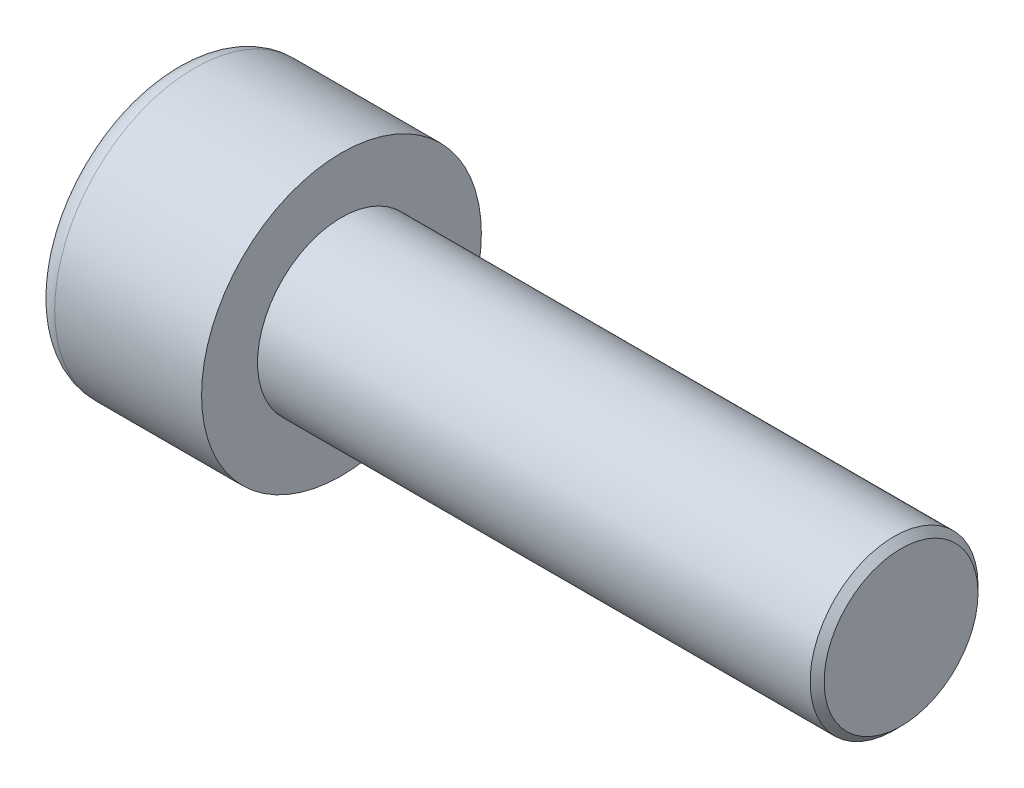
ISO-10303-21;
HEADER;
FILE_DESCRIPTION(('STEP AP214'),'2;1');
FILE_NAME('part.step','',(''),(''),'','','');
FILE_SCHEMA(('AUTOMOTIVE_DESIGN { 1 0 10303 214 1 1 1 1 }'));
ENDSEC;
DATA;
#1=APPLICATION_CONTEXT('core data for automotive mechanical design processes');
#2=APPLICATION_PROTOCOL_DEFINITION('international standard','automotive_design',2000,#1);
#3=PRODUCT_CONTEXT('',#1,'mechanical');
#4=PRODUCT('Part','Part','',(#3));
#5=PRODUCT_RELATED_PRODUCT_CATEGORY('part','',(#4));
#6=PRODUCT_DEFINITION_FORMATION('','',#4);
#7=PRODUCT_DEFINITION_CONTEXT('part definition',#1,'design');
#8=PRODUCT_DEFINITION('design','',#6,#7);
#9=PRODUCT_DEFINITION_SHAPE('','',#8);
#10=(LENGTH_UNIT() NAMED_UNIT(*) SI_UNIT(.MILLI.,.METRE.));
#11=(NAMED_UNIT(*) PLANE_ANGLE_UNIT() SI_UNIT($,.RADIAN.));
#12=(NAMED_UNIT(*) SI_UNIT($,.STERADIAN.) SOLID_ANGLE_UNIT());
#13=UNCERTAINTY_MEASURE_WITH_UNIT(LENGTH_MEASURE(1.E-05),#10,'distance_accuracy_value','');
#14=(GEOMETRIC_REPRESENTATION_CONTEXT(3) GLOBAL_UNCERTAINTY_ASSIGNED_CONTEXT((#13)) GLOBAL_UNIT_ASSIGNED_CONTEXT((#10,
#11,#12)) REPRESENTATION_CONTEXT('',''));
#15=CARTESIAN_POINT('',(0.,0.,0.));
#16=DIRECTION('',(0.,0.,1.));
#17=DIRECTION('',(1.,0.,0.));
#18=AXIS2_PLACEMENT_3D('',#15,#16,#17);
#19=CARTESIAN_POINT('',(3.,0.,-2.88675134594813));
#20=DIRECTION('',(1.,0.,0.));
#21=DIRECTION('',(0.,0.,-1.));
#22=AXIS2_PLACEMENT_3D('',#19,#20,#21);
#23=PLANE('',#22);
#24=CARTESIAN_POINT('',(3.,0.,0.));
#25=DIRECTION('',(1.,0.,0.));
#26=DIRECTION('',(0.,0.,-1.));
#27=AXIS2_PLACEMENT_3D('',#24,#25,#26);
#28=CIRCLE('',#27,2.5);
#29=CARTESIAN_POINT('',(3.,-1.25,-2.1650635094611));
#30=VERTEX_POINT('',#29);
#31=CARTESIAN_POINT('',(3.,-2.5,0.));
#32=VERTEX_POINT('',#31);
#33=EDGE_CURVE('E164',#30,#32,#28,.F.);
#34=ORIENTED_EDGE('',*,*,#33,.F.);
#35=DIRECTION('',(0.,0.866025403784439,-0.5));
#36=VECTOR('',#35,1.);
#37=CARTESIAN_POINT('',(3.,-2.5,-1.44337567297407));
#38=LINE('',#37,#36);
#39=CARTESIAN_POINT('',(3.,-2.5,-1.44337567297407));
#40=VERTEX_POINT('',#39);
#41=EDGE_CURVE('E172',#40,#30,#38,.T.);
#42=ORIENTED_EDGE('',*,*,#41,.F.);
#43=DIRECTION('',(0.,0.,-1.));
#44=VECTOR('',#43,1.);
#45=CARTESIAN_POINT('',(3.,-2.5,1.44337567297406));
#46=LINE('',#45,#44);
#47=EDGE_CURVE('E189',#32,#40,#46,.T.);
#48=ORIENTED_EDGE('',*,*,#47,.F.);
#49=EDGE_LOOP('',(#34,#42,#48));
#50=FACE_BOUND('',#49,.T.);
#51=ADVANCED_FACE('F41',(#50),#23,.F.);
#52=CARTESIAN_POINT('',(3.,-1.25,2.1650635094611));
#53=VERTEX_POINT('',#52);
#54=EDGE_CURVE('E294',#32,#53,#28,.F.);
#55=ORIENTED_EDGE('',*,*,#54,.F.);
#56=CARTESIAN_POINT('',(3.,-2.5,1.44337567297406));
#57=VERTEX_POINT('',#56);
#58=EDGE_CURVE('E190',#57,#32,#46,.T.);
#59=ORIENTED_EDGE('',*,*,#58,.F.);
#60=DIRECTION('',(0.,-0.866025403784438,-0.5));
#61=VECTOR('',#60,1.);
#62=CARTESIAN_POINT('',(3.,0.,2.88675134594813));
#63=LINE('',#62,#61);
#64=EDGE_CURVE('E185',#53,#57,#63,.T.);
#65=ORIENTED_EDGE('',*,*,#64,.F.);
#66=EDGE_LOOP('',(#55,#59,#65));
#67=FACE_BOUND('',#66,.T.);
#68=ADVANCED_FACE('F130',(#67),#23,.F.);
#69=CARTESIAN_POINT('',(3.,1.25,2.1650635094611));
#70=VERTEX_POINT('',#69);
#71=EDGE_CURVE('E290',#53,#70,#28,.F.);
#72=ORIENTED_EDGE('',*,*,#71,.F.);
#73=CARTESIAN_POINT('',(3.,0.,2.88675134594813));
#74=VERTEX_POINT('',#73);
#75=EDGE_CURVE('E186',#74,#53,#63,.T.);
#76=ORIENTED_EDGE('',*,*,#75,.F.);
#77=DIRECTION('',(0.,-0.866025403784439,0.5));
#78=VECTOR('',#77,1.);
#79=CARTESIAN_POINT('',(3.,2.5,1.44337567297406));
#80=LINE('',#79,#78);
#81=EDGE_CURVE('E181',#70,#74,#80,.T.);
#82=ORIENTED_EDGE('',*,*,#81,.F.);
#83=EDGE_LOOP('',(#72,#76,#82));
#84=FACE_BOUND('',#83,.T.);
#85=ADVANCED_FACE('F136',(#84),#23,.F.);
#86=CARTESIAN_POINT('',(3.,2.5,0.));
#87=VERTEX_POINT('',#86);
#88=EDGE_CURVE('E161',#70,#87,#28,.F.);
#89=ORIENTED_EDGE('',*,*,#88,.F.);
#90=CARTESIAN_POINT('',(3.,2.5,1.44337567297406));
#91=VERTEX_POINT('',#90);
#92=EDGE_CURVE('E182',#91,#70,#80,.T.);
#93=ORIENTED_EDGE('',*,*,#92,.F.);
#94=DIRECTION('',(0.,0.,1.));
#95=VECTOR('',#94,1.);
#96=CARTESIAN_POINT('',(3.,2.5,-1.44337567297406));
#97=LINE('',#96,#95);
#98=EDGE_CURVE('E176',#87,#91,#97,.T.);
#99=ORIENTED_EDGE('',*,*,#98,.F.);
#100=EDGE_LOOP('',(#89,#93,#99));
#101=FACE_BOUND('',#100,.T.);
#102=ADVANCED_FACE('F150',(#101),#23,.F.);
#103=CARTESIAN_POINT('',(3.,0.,0.));
#104=DIRECTION('',(1.,0.,0.));
#105=DIRECTION('',(0.,0.,-1.));
#106=AXIS2_PLACEMENT_3D('',#103,#104,#105);
#107=CIRCLE('',#106,2.5);
#108=CARTESIAN_POINT('',(3.,1.25,-2.1650635094611));
#109=VERTEX_POINT('',#108);
#110=EDGE_CURVE('E56',#109,#87,#107,.T.);
#111=ORIENTED_EDGE('',*,*,#110,.T.);
#112=CARTESIAN_POINT('',(3.,2.5,-1.44337567297406));
#113=VERTEX_POINT('',#112);
#114=EDGE_CURVE('E169',#113,#87,#97,.T.);
#115=ORIENTED_EDGE('',*,*,#114,.F.);
#116=DIRECTION('',(0.,0.866025403784438,0.5));
#117=VECTOR('',#116,1.);
#118=CARTESIAN_POINT('',(3.,0.,-2.88675134594813));
#119=LINE('',#118,#117);
#120=EDGE_CURVE('E166',#109,#113,#119,.T.);
#121=ORIENTED_EDGE('',*,*,#120,.F.);
#122=EDGE_LOOP('',(#111,#115,#121));
#123=FACE_BOUND('',#122,.T.);
#124=ADVANCED_FACE('F141',(#123),#23,.F.);
#125=EDGE_CURVE('E154',#109,#30,#28,.F.);
#126=ORIENTED_EDGE('',*,*,#125,.F.);
#127=CARTESIAN_POINT('',(3.,0.,-2.88675134594813));
#128=VERTEX_POINT('',#127);
#129=EDGE_CURVE('E157',#128,#109,#119,.T.);
#130=ORIENTED_EDGE('',*,*,#129,.F.);
#131=EDGE_CURVE('E159',#30,#128,#38,.T.);
#132=ORIENTED_EDGE('',*,*,#131,.F.);
#133=EDGE_LOOP('',(#126,#130,#132));
#134=FACE_BOUND('',#133,.T.);
#135=ADVANCED_FACE('F132',(#134),#23,.F.);
#136=CARTESIAN_POINT('',(0.,0.,0.));
#137=DIRECTION('',(1.,0.,0.));
#138=DIRECTION('',(0.,0.,-1.));
#139=AXIS2_PLACEMENT_3D('',#136,#137,#138);
#140=PLANE('',#139);
#141=CARTESIAN_POINT('',(0.,0.,0.));
#142=DIRECTION('',(1.,0.,0.));
#143=DIRECTION('',(0.,0.,-1.));
#144=AXIS2_PLACEMENT_3D('',#141,#142,#143);
#145=CIRCLE('',#144,4.25);
#146=CARTESIAN_POINT('',(0.,0.,-4.25));
#147=VERTEX_POINT('',#146);
#148=EDGE_CURVE('E229',#147,#147,#145,.F.);
#149=ORIENTED_EDGE('',*,*,#148,.T.);
#150=EDGE_LOOP('',(#149));
#151=FACE_BOUND('',#150,.T.);
#152=DIRECTION('',(0.,0.866025403784439,-0.5));
#153=VECTOR('',#152,1.);
#154=CARTESIAN_POINT('',(0.,-2.5,-1.44337567297407));
#155=LINE('',#154,#153);
#156=CARTESIAN_POINT('',(0.,-2.5,-1.44337567297407));
#157=VERTEX_POINT('',#156);
#158=CARTESIAN_POINT('',(0.,0.,-2.88675134594813));
#159=VERTEX_POINT('',#158);
#160=EDGE_CURVE('E64',#157,#159,#155,.T.);
#161=ORIENTED_EDGE('',*,*,#160,.T.);
#162=DIRECTION('',(0.,0.866025403784438,0.5));
#163=VECTOR('',#162,1.);
#164=CARTESIAN_POINT('',(0.,0.,-2.88675134594813));
#165=LINE('',#164,#163);
#166=CARTESIAN_POINT('',(0.,2.5,-1.44337567297406));
#167=VERTEX_POINT('',#166);
#168=EDGE_CURVE('E195',#159,#167,#165,.T.);
#169=ORIENTED_EDGE('',*,*,#168,.T.);
#170=DIRECTION('',(0.,0.,1.));
#171=VECTOR('',#170,1.);
#172=CARTESIAN_POINT('',(0.,2.5,-1.44337567297406));
#173=LINE('',#172,#171);
#174=CARTESIAN_POINT('',(0.,2.5,1.44337567297406));
#175=VERTEX_POINT('',#174);
#176=EDGE_CURVE('E198',#167,#175,#173,.T.);
#177=ORIENTED_EDGE('',*,*,#176,.T.);
#178=DIRECTION('',(0.,-0.866025403784439,0.5));
#179=VECTOR('',#178,1.);
#180=CARTESIAN_POINT('',(0.,2.5,1.44337567297406));
#181=LINE('',#180,#179);
#182=CARTESIAN_POINT('',(0.,0.,2.88675134594813));
#183=VERTEX_POINT('',#182);
#184=EDGE_CURVE('E201',#175,#183,#181,.T.);
#185=ORIENTED_EDGE('',*,*,#184,.T.);
#186=DIRECTION('',(0.,-0.866025403784438,-0.5));
#187=VECTOR('',#186,1.);
#188=CARTESIAN_POINT('',(0.,0.,2.88675134594813));
#189=LINE('',#188,#187);
#190=CARTESIAN_POINT('',(0.,-2.5,1.44337567297406));
#191=VERTEX_POINT('',#190);
#192=EDGE_CURVE('E204',#183,#191,#189,.T.);
#193=ORIENTED_EDGE('',*,*,#192,.T.);
#194=DIRECTION('',(0.,0.,-1.));
#195=VECTOR('',#194,1.);
#196=CARTESIAN_POINT('',(0.,-2.5,1.44337567297406));
#197=LINE('',#196,#195);
#198=EDGE_CURVE('E207',#191,#157,#197,.T.);
#199=ORIENTED_EDGE('',*,*,#198,.T.);
#200=EDGE_LOOP('',(#161,#169,#177,#185,#193,#199));
#201=FACE_BOUND('',#200,.T.);
#202=ADVANCED_FACE('F140',(#151,#201),#140,.F.);
#203=CARTESIAN_POINT('',(6.,0.,0.));
#204=DIRECTION('',(1.,0.,0.));
#205=DIRECTION('',(0.,0.,-1.));
#206=AXIS2_PLACEMENT_3D('',#203,#204,#205);
#207=PLANE('',#206);
#208=CARTESIAN_POINT('',(6.,0.,0.));
#209=DIRECTION('',(1.,0.,0.));
#210=DIRECTION('',(0.,0.,-1.));
#211=AXIS2_PLACEMENT_3D('',#208,#209,#210);
#212=CIRCLE('',#211,5.);
#213=CARTESIAN_POINT('',(6.,0.,-5.));
#214=VERTEX_POINT('',#213);
#215=EDGE_CURVE('E162',#214,#214,#212,.T.);
#216=ORIENTED_EDGE('',*,*,#215,.T.);
#217=EDGE_LOOP('',(#216));
#218=FACE_BOUND('',#217,.T.);
#219=CARTESIAN_POINT('',(6.,0.,0.));
#220=DIRECTION('',(1.,0.,0.));
#221=DIRECTION('',(0.,0.,-1.));
#222=AXIS2_PLACEMENT_3D('',#219,#220,#221);
#223=CIRCLE('',#222,3.);
#224=CARTESIAN_POINT('',(6.,0.,-3.));
#225=VERTEX_POINT('',#224);
#226=EDGE_CURVE('E220',#225,#225,#223,.T.);
#227=ORIENTED_EDGE('',*,*,#226,.F.);
#228=EDGE_LOOP('',(#227));
#229=FACE_BOUND('',#228,.T.);
#230=ADVANCED_FACE('F147',(#218,#229),#207,.T.);
#231=CARTESIAN_POINT('',(6.,0.,0.));
#232=DIRECTION('',(-1.,0.,0.));
#233=DIRECTION('',(0.,0.,1.));
#234=AXIS2_PLACEMENT_3D('',#231,#232,#233);
#235=CYLINDRICAL_SURFACE('',#234,5.);
#236=CARTESIAN_POINT('',(0.75,0.,0.));
#237=DIRECTION('',(1.,0.,0.));
#238=DIRECTION('',(0.,0.,-1.));
#239=AXIS2_PLACEMENT_3D('',#236,#237,#238);
#240=CIRCLE('',#239,5.);
#241=CARTESIAN_POINT('',(0.75,0.,-5.));
#242=VERTEX_POINT('',#241);
#243=EDGE_CURVE('E226',#242,#242,#240,.T.);
#244=ORIENTED_EDGE('',*,*,#243,.T.);
#245=EDGE_LOOP('',(#244));
#246=FACE_BOUND('',#245,.T.);
#247=ORIENTED_EDGE('',*,*,#215,.F.);
#248=EDGE_LOOP('',(#247));
#249=FACE_BOUND('',#248,.T.);
#250=ADVANCED_FACE('F245',(#246,#249),#235,.T.);
#251=CARTESIAN_POINT('',(26.,0.,0.));
#252=DIRECTION('',(-1.,0.,0.));
#253=DIRECTION('',(0.,0.,1.));
#254=AXIS2_PLACEMENT_3D('',#251,#252,#253);
#255=CYLINDRICAL_SURFACE('',#254,3.);
#256=CARTESIAN_POINT('',(25.75,0.,0.));
#257=DIRECTION('',(1.,0.,0.));
#258=DIRECTION('',(0.,0.,-1.));
#259=AXIS2_PLACEMENT_3D('',#256,#257,#258);
#260=CIRCLE('',#259,3.);
#261=CARTESIAN_POINT('',(25.75,0.,-3.));
#262=VERTEX_POINT('',#261);
#263=EDGE_CURVE('E11',#262,#262,#260,.F.);
#264=ORIENTED_EDGE('',*,*,#263,.T.);
#265=EDGE_LOOP('',(#264));
#266=FACE_BOUND('',#265,.T.);
#267=ORIENTED_EDGE('',*,*,#226,.T.);
#268=EDGE_LOOP('',(#267));
#269=FACE_BOUND('',#268,.T.);
#270=ADVANCED_FACE('F242',(#266,#269),#255,.T.);
#271=CARTESIAN_POINT('',(26.,0.,0.));
#272=DIRECTION('',(1.,0.,0.));
#273=DIRECTION('',(0.,0.,-1.));
#274=AXIS2_PLACEMENT_3D('',#271,#272,#273);
#275=PLANE('',#274);
#276=CARTESIAN_POINT('',(26.,0.,0.));
#277=DIRECTION('',(1.,0.,0.));
#278=DIRECTION('',(0.,0.,-1.));
#279=AXIS2_PLACEMENT_3D('',#276,#277,#278);
#280=CIRCLE('',#279,2.74999999999999);
#281=CARTESIAN_POINT('',(26.,0.,-2.74999999999999));
#282=VERTEX_POINT('',#281);
#283=EDGE_CURVE('E49',#282,#282,#280,.T.);
#284=ORIENTED_EDGE('',*,*,#283,.T.);
#285=EDGE_LOOP('',(#284));
#286=FACE_BOUND('',#285,.T.);
#287=ADVANCED_FACE('F234',(#286),#275,.T.);
#288=CARTESIAN_POINT('',(3.,-2.5,-1.44337567297407));
#289=DIRECTION('',(0.,0.5,0.866025403784439));
#290=DIRECTION('',(0.,-0.866025403784439,0.5));
#291=AXIS2_PLACEMENT_3D('',#288,#289,#290);
#292=PLANE('',#291);
#293=ORIENTED_EDGE('',*,*,#160,.F.);
#294=DIRECTION('',(-1.,0.,0.));
#295=VECTOR('',#294,1.);
#296=CARTESIAN_POINT('',(3.,-2.5,-1.44337567297407));
#297=LINE('',#296,#295);
#298=EDGE_CURVE('E193',#40,#157,#297,.T.);
#299=ORIENTED_EDGE('',*,*,#298,.F.);
#300=ORIENTED_EDGE('',*,*,#41,.T.);
#301=ORIENTED_EDGE('',*,*,#131,.T.);
#302=DIRECTION('',(-1.,0.,0.));
#303=VECTOR('',#302,1.);
#304=CARTESIAN_POINT('',(3.,0.,-2.88675134594813));
#305=LINE('',#304,#303);
#306=EDGE_CURVE('E175',#128,#159,#305,.T.);
#307=ORIENTED_EDGE('',*,*,#306,.T.);
#308=EDGE_LOOP('',(#293,#299,#300,#301,#307));
#309=FACE_BOUND('',#308,.T.);
#310=ADVANCED_FACE('F260',(#309),#292,.T.);
#311=CARTESIAN_POINT('',(3.,0.,-2.88675134594813));
#312=DIRECTION('',(0.,-0.5,0.866025403784438));
#313=DIRECTION('',(0.,-0.866025403784439,-0.5));
#314=AXIS2_PLACEMENT_3D('',#311,#312,#313);
#315=PLANE('',#314);
#316=ORIENTED_EDGE('',*,*,#168,.F.);
#317=ORIENTED_EDGE('',*,*,#306,.F.);
#318=ORIENTED_EDGE('',*,*,#129,.T.);
#319=ORIENTED_EDGE('',*,*,#120,.T.);
#320=DIRECTION('',(-1.,0.,0.));
#321=VECTOR('',#320,1.);
#322=CARTESIAN_POINT('',(3.,2.5,-1.44337567297406));
#323=LINE('',#322,#321);
#324=EDGE_CURVE('E217',#113,#167,#323,.T.);
#325=ORIENTED_EDGE('',*,*,#324,.T.);
#326=EDGE_LOOP('',(#316,#317,#318,#319,#325));
#327=FACE_BOUND('',#326,.T.);
#328=ADVANCED_FACE('F174',(#327),#315,.T.);
#329=CARTESIAN_POINT('',(3.,2.5,-1.44337567297406));
#330=DIRECTION('',(0.,-1.,0.));
#331=DIRECTION('',(0.,0.,-1.));
#332=AXIS2_PLACEMENT_3D('',#329,#330,#331);
#333=PLANE('',#332);
#334=ORIENTED_EDGE('',*,*,#176,.F.);
#335=ORIENTED_EDGE('',*,*,#324,.F.);
#336=ORIENTED_EDGE('',*,*,#114,.T.);
#337=ORIENTED_EDGE('',*,*,#98,.T.);
#338=DIRECTION('',(-1.,0.,0.));
#339=VECTOR('',#338,1.);
#340=CARTESIAN_POINT('',(3.,2.5,1.44337567297406));
#341=LINE('',#340,#339);
#342=EDGE_CURVE('E215',#91,#175,#341,.T.);
#343=ORIENTED_EDGE('',*,*,#342,.T.);
#344=EDGE_LOOP('',(#334,#335,#336,#337,#343));
#345=FACE_BOUND('',#344,.T.);
#346=ADVANCED_FACE('F265',(#345),#333,.T.);
#347=CARTESIAN_POINT('',(3.,2.5,1.44337567297406));
#348=DIRECTION('',(0.,-0.5,-0.866025403784439));
#349=DIRECTION('',(0.,0.866025403784439,-0.5));
#350=AXIS2_PLACEMENT_3D('',#347,#348,#349);
#351=PLANE('',#350);
#352=ORIENTED_EDGE('',*,*,#184,.F.);
#353=ORIENTED_EDGE('',*,*,#342,.F.);
#354=ORIENTED_EDGE('',*,*,#92,.T.);
#355=ORIENTED_EDGE('',*,*,#81,.T.);
#356=DIRECTION('',(-1.,0.,0.));
#357=VECTOR('',#356,1.);
#358=CARTESIAN_POINT('',(3.,0.,2.88675134594813));
#359=LINE('',#358,#357);
#360=EDGE_CURVE('E213',#74,#183,#359,.T.);
#361=ORIENTED_EDGE('',*,*,#360,.T.);
#362=EDGE_LOOP('',(#352,#353,#354,#355,#361));
#363=FACE_BOUND('',#362,.T.);
#364=ADVANCED_FACE('F268',(#363),#351,.T.);
#365=CARTESIAN_POINT('',(3.,0.,2.88675134594813));
#366=DIRECTION('',(0.,0.5,-0.866025403784439));
#367=DIRECTION('',(0.,0.866025403784439,0.5));
#368=AXIS2_PLACEMENT_3D('',#365,#366,#367);
#369=PLANE('',#368);
#370=ORIENTED_EDGE('',*,*,#192,.F.);
#371=ORIENTED_EDGE('',*,*,#360,.F.);
#372=ORIENTED_EDGE('',*,*,#75,.T.);
#373=ORIENTED_EDGE('',*,*,#64,.T.);
#374=DIRECTION('',(-1.,0.,0.));
#375=VECTOR('',#374,1.);
#376=CARTESIAN_POINT('',(3.,-2.5,1.44337567297406));
#377=LINE('',#376,#375);
#378=EDGE_CURVE('E211',#57,#191,#377,.T.);
#379=ORIENTED_EDGE('',*,*,#378,.T.);
#380=EDGE_LOOP('',(#370,#371,#372,#373,#379));
#381=FACE_BOUND('',#380,.T.);
#382=ADVANCED_FACE('F125',(#381),#369,.T.);
#383=CARTESIAN_POINT('',(3.,-2.5,1.44337567297406));
#384=DIRECTION('',(0.,1.,0.));
#385=DIRECTION('',(0.,0.,1.));
#386=AXIS2_PLACEMENT_3D('',#383,#384,#385);
#387=PLANE('',#386);
#388=ORIENTED_EDGE('',*,*,#198,.F.);
#389=ORIENTED_EDGE('',*,*,#378,.F.);
#390=ORIENTED_EDGE('',*,*,#58,.T.);
#391=ORIENTED_EDGE('',*,*,#47,.T.);
#392=ORIENTED_EDGE('',*,*,#298,.T.);
#393=EDGE_LOOP('',(#388,#389,#390,#391,#392));
#394=FACE_BOUND('',#393,.T.);
#395=ADVANCED_FACE('F118',(#394),#387,.T.);
#396=CARTESIAN_POINT('',(3.,0.,0.));
#397=DIRECTION('',(-1.,0.,0.));
#398=DIRECTION('',(0.,0.,1.));
#399=AXIS2_PLACEMENT_3D('',#396,#397,#398);
#400=CONICAL_SURFACE('',#399,2.5,1.04719755119659);
#401=CARTESIAN_POINT('',(4.44337567297408,0.,0.));
#402=VERTEX_POINT('',#401);
#403=VERTEX_LOOP('',#402);
#404=FACE_BOUND('',#403,.T.);
#405=ORIENTED_EDGE('',*,*,#110,.F.);
#406=ORIENTED_EDGE('',*,*,#125,.T.);
#407=ORIENTED_EDGE('',*,*,#33,.T.);
#408=ORIENTED_EDGE('',*,*,#54,.T.);
#409=ORIENTED_EDGE('',*,*,#71,.T.);
#410=ORIENTED_EDGE('',*,*,#88,.T.);
#411=EDGE_LOOP('',(#405,#406,#407,#408,#409,#410));
#412=FACE_BOUND('',#411,.T.);
#413=ADVANCED_FACE('F115',(#404,#412),#400,.F.);
#414=CARTESIAN_POINT('',(0.75,0.,0.));
#415=DIRECTION('',(1.,0.,0.));
#416=DIRECTION('',(0.,0.,-1.));
#417=AXIS2_PLACEMENT_3D('',#414,#415,#416);
#418=TOROIDAL_SURFACE('',#417,4.25,0.75);
#419=ORIENTED_EDGE('',*,*,#148,.F.);
#420=EDGE_LOOP('',(#419));
#421=FACE_BOUND('',#420,.T.);
#422=ORIENTED_EDGE('',*,*,#243,.F.);
#423=EDGE_LOOP('',(#422));
#424=FACE_BOUND('',#423,.T.);
#425=ADVANCED_FACE('F117',(#421,#424),#418,.T.);
#426=CARTESIAN_POINT('',(26.,0.,0.));
#427=DIRECTION('',(-1.,0.,0.));
#428=DIRECTION('',(0.,0.,1.));
#429=AXIS2_PLACEMENT_3D('',#426,#427,#428);
#430=CONICAL_SURFACE('',#429,2.74999999999999,0.785398163397451);
#431=ORIENTED_EDGE('',*,*,#263,.F.);
#432=EDGE_LOOP('',(#431));
#433=FACE_BOUND('',#432,.T.);
#434=ORIENTED_EDGE('',*,*,#283,.F.);
#435=EDGE_LOOP('',(#434));
#436=FACE_BOUND('',#435,.T.);
#437=ADVANCED_FACE('F43',(#433,#436),#430,.T.);
#438=CLOSED_SHELL('',(#51,#68,#85,#102,#124,#135,#202,#230,#250,#270,#287,#310,#328,#346,#364,
#382,#395,#413,#425,#437));
#439=MANIFOLD_SOLID_BREP('B2',#438);
#440=ADVANCED_BREP_SHAPE_REPRESENTATION('',(#18,#439),#14);
#441=SHAPE_DEFINITION_REPRESENTATION(#9,#440);
ENDSEC;
END-ISO-10303-21;
